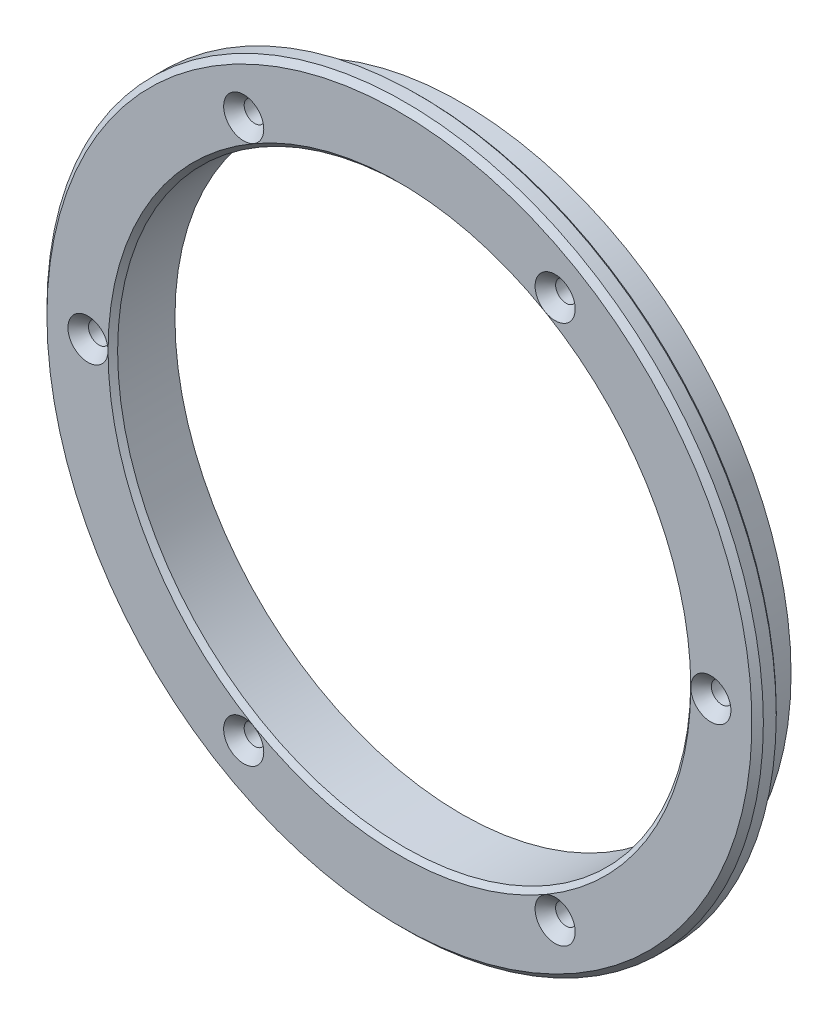
ISO-10303-21;
HEADER;
FILE_DESCRIPTION(('STEP AP214'),'2;1');
FILE_NAME('part.step','',(''),(''),'','','');
FILE_SCHEMA(('AUTOMOTIVE_DESIGN { 1 0 10303 214 1 1 1 1 }'));
ENDSEC;
DATA;
#1=APPLICATION_CONTEXT('core data for automotive mechanical design processes');
#2=APPLICATION_PROTOCOL_DEFINITION('international standard','automotive_design',2000,#1);
#3=PRODUCT_CONTEXT('',#1,'mechanical');
#4=PRODUCT('Part','Part','',(#3));
#5=PRODUCT_RELATED_PRODUCT_CATEGORY('part','',(#4));
#6=PRODUCT_DEFINITION_FORMATION('','',#4);
#7=PRODUCT_DEFINITION_CONTEXT('part definition',#1,'design');
#8=PRODUCT_DEFINITION('design','',#6,#7);
#9=PRODUCT_DEFINITION_SHAPE('','',#8);
#10=(LENGTH_UNIT() NAMED_UNIT(*) SI_UNIT(.MILLI.,.METRE.));
#11=(NAMED_UNIT(*) PLANE_ANGLE_UNIT() SI_UNIT($,.RADIAN.));
#12=(NAMED_UNIT(*) SI_UNIT($,.STERADIAN.) SOLID_ANGLE_UNIT());
#13=UNCERTAINTY_MEASURE_WITH_UNIT(LENGTH_MEASURE(1.E-05),#10,'distance_accuracy_value','');
#14=(GEOMETRIC_REPRESENTATION_CONTEXT(3) GLOBAL_UNCERTAINTY_ASSIGNED_CONTEXT((#13)) GLOBAL_UNIT_ASSIGNED_CONTEXT((#10,
#11,#12)) REPRESENTATION_CONTEXT('',''));
#15=CARTESIAN_POINT('',(0.,0.,0.));
#16=DIRECTION('',(0.,0.,1.));
#17=DIRECTION('',(1.,0.,0.));
#18=AXIS2_PLACEMENT_3D('',#15,#16,#17);
#19=CARTESIAN_POINT('',(0.,0.,12.7));
#20=DIRECTION('',(0.,0.,-1.));
#21=DIRECTION('',(-1.,0.,0.));
#22=AXIS2_PLACEMENT_3D('',#19,#20,#21);
#23=PLANE('',#22);
#24=CARTESIAN_POINT('',(0.,0.,12.7));
#25=DIRECTION('',(0.,0.,-1.));
#26=DIRECTION('',(-1.,0.,0.));
#27=AXIS2_PLACEMENT_3D('',#24,#25,#26);
#28=CIRCLE('',#27,46.863);
#29=CARTESIAN_POINT('',(-46.863,0.,12.7));
#30=VERTEX_POINT('',#29);
#31=EDGE_CURVE('E40',#30,#30,#28,.F.);
#32=ORIENTED_EDGE('',*,*,#31,.T.);
#33=EDGE_LOOP('',(#32));
#34=FACE_BOUND('',#33,.T.);
#35=CARTESIAN_POINT('',(0.,0.,12.7));
#36=DIRECTION('',(0.,0.,-1.));
#37=DIRECTION('',(-1.,0.,0.));
#38=AXIS2_PLACEMENT_3D('',#35,#36,#37);
#39=CIRCLE('',#38,38.735);
#40=CARTESIAN_POINT('',(19.3674999999999,33.5454940155903,12.7));
#41=VERTEX_POINT('',#40);
#42=CARTESIAN_POINT('',(38.735,0.,12.7));
#43=VERTEX_POINT('',#42);
#44=EDGE_CURVE('E76',#41,#43,#39,.T.);
#45=ORIENTED_EDGE('',*,*,#44,.T.);
#46=CARTESIAN_POINT('',(41.402,0.,12.7));
#47=DIRECTION('',(0.,0.,1.));
#48=DIRECTION('',(1.,0.,0.));
#49=AXIS2_PLACEMENT_3D('',#46,#47,#48);
#50=CIRCLE('',#49,2.667);
#51=EDGE_CURVE('E45',#43,#43,#50,.T.);
#52=ORIENTED_EDGE('',*,*,#51,.F.);
#53=CARTESIAN_POINT('',(19.3675000000002,-33.5454940155901,12.7));
#54=VERTEX_POINT('',#53);
#55=EDGE_CURVE('E51',#43,#54,#39,.T.);
#56=ORIENTED_EDGE('',*,*,#55,.T.);
#57=CARTESIAN_POINT('',(20.701,-35.8551837674833,12.7));
#58=DIRECTION('',(0.,0.,1.));
#59=DIRECTION('',(1.,0.,0.));
#60=AXIS2_PLACEMENT_3D('',#57,#58,#59);
#61=CIRCLE('',#60,2.667);
#62=EDGE_CURVE('E72',#54,#54,#61,.T.);
#63=ORIENTED_EDGE('',*,*,#62,.F.);
#64=CARTESIAN_POINT('',(-19.3674999999998,-33.5454940155904,12.7));
#65=VERTEX_POINT('',#64);
#66=EDGE_CURVE('E66',#54,#65,#39,.T.);
#67=ORIENTED_EDGE('',*,*,#66,.T.);
#68=CARTESIAN_POINT('',(-20.701,-35.8551837674834,12.7));
#69=DIRECTION('',(0.,0.,1.));
#70=DIRECTION('',(1.,0.,0.));
#71=AXIS2_PLACEMENT_3D('',#68,#69,#70);
#72=CIRCLE('',#71,2.667);
#73=EDGE_CURVE('E70',#65,#65,#72,.T.);
#74=ORIENTED_EDGE('',*,*,#73,.F.);
#75=CARTESIAN_POINT('',(-38.735,0.,12.7));
#76=VERTEX_POINT('',#75);
#77=EDGE_CURVE('E102',#65,#76,#39,.T.);
#78=ORIENTED_EDGE('',*,*,#77,.T.);
#79=CARTESIAN_POINT('',(-41.402,0.,12.7));
#80=DIRECTION('',(0.,0.,1.));
#81=DIRECTION('',(1.,0.,0.));
#82=AXIS2_PLACEMENT_3D('',#79,#80,#81);
#83=CIRCLE('',#82,2.667);
#84=EDGE_CURVE('E258',#76,#76,#83,.T.);
#85=ORIENTED_EDGE('',*,*,#84,.F.);
#86=CARTESIAN_POINT('',(-19.3675000000002,33.5454940155901,12.7));
#87=VERTEX_POINT('',#86);
#88=EDGE_CURVE('E105',#76,#87,#39,.T.);
#89=ORIENTED_EDGE('',*,*,#88,.T.);
#90=CARTESIAN_POINT('',(-20.701,35.8551837674833,12.7));
#91=DIRECTION('',(0.,0.,1.));
#92=DIRECTION('',(1.,0.,0.));
#93=AXIS2_PLACEMENT_3D('',#90,#91,#92);
#94=CIRCLE('',#93,2.667);
#95=EDGE_CURVE('E252',#87,#87,#94,.T.);
#96=ORIENTED_EDGE('',*,*,#95,.F.);
#97=EDGE_CURVE('E269',#87,#41,#39,.T.);
#98=ORIENTED_EDGE('',*,*,#97,.T.);
#99=CARTESIAN_POINT('',(20.701,35.8551837674834,12.7));
#100=DIRECTION('',(0.,0.,1.));
#101=DIRECTION('',(1.,0.,0.));
#102=AXIS2_PLACEMENT_3D('',#99,#100,#101);
#103=CIRCLE('',#102,2.667);
#104=EDGE_CURVE('E246',#41,#41,#103,.T.);
#105=ORIENTED_EDGE('',*,*,#104,.F.);
#106=EDGE_LOOP('',(#45,#52,#56,#63,#67,#74,#78,#85,#89,#96,#98,#105));
#107=FACE_BOUND('',#106,.T.);
#108=ADVANCED_FACE('F32',(#34,#107),#23,.F.);
#109=CARTESIAN_POINT('',(0.,0.,4.445));
#110=DIRECTION('',(0.,0.,1.));
#111=DIRECTION('',(1.,0.,0.));
#112=AXIS2_PLACEMENT_3D('',#109,#110,#111);
#113=CYLINDRICAL_SURFACE('',#112,47.625);
#114=CARTESIAN_POINT('',(0.,0.,11.938));
#115=DIRECTION('',(0.,0.,-1.));
#116=DIRECTION('',(-1.,0.,0.));
#117=AXIS2_PLACEMENT_3D('',#114,#115,#116);
#118=CIRCLE('',#117,47.625);
#119=CARTESIAN_POINT('',(-47.625,0.,11.938));
#120=VERTEX_POINT('',#119);
#121=EDGE_CURVE('E11',#120,#120,#118,.T.);
#122=ORIENTED_EDGE('',*,*,#121,.T.);
#123=EDGE_LOOP('',(#122));
#124=FACE_BOUND('',#123,.T.);
#125=CARTESIAN_POINT('',(0.,0.,10.2235));
#126=DIRECTION('',(0.,0.,1.));
#127=DIRECTION('',(1.,0.,0.));
#128=AXIS2_PLACEMENT_3D('',#125,#126,#127);
#129=CIRCLE('',#128,47.625);
#130=CARTESIAN_POINT('',(47.625,0.,10.2235));
#131=VERTEX_POINT('',#130);
#132=EDGE_CURVE('E108',#131,#131,#129,.T.);
#133=ORIENTED_EDGE('',*,*,#132,.T.);
#134=EDGE_LOOP('',(#133));
#135=FACE_BOUND('',#134,.T.);
#136=ADVANCED_FACE('F124',(#124,#135),#113,.T.);
#137=CARTESIAN_POINT('',(0.,0.,4.445));
#138=DIRECTION('',(0.,0.,-1.));
#139=DIRECTION('',(-1.,0.,0.));
#140=AXIS2_PLACEMENT_3D('',#137,#138,#139);
#141=PLANE('',#140);
#142=CARTESIAN_POINT('',(41.402,0.,4.445));
#143=DIRECTION('',(0.,0.,-1.));
#144=DIRECTION('',(-1.,0.,0.));
#145=AXIS2_PLACEMENT_3D('',#142,#143,#144);
#146=CIRCLE('',#145,1.397);
#147=CARTESIAN_POINT('',(40.005,0.,4.445));
#148=VERTEX_POINT('',#147);
#149=EDGE_CURVE('E164',#148,#148,#146,.T.);
#150=ORIENTED_EDGE('',*,*,#149,.F.);
#151=EDGE_LOOP('',(#150));
#152=FACE_BOUND('',#151,.T.);
#153=CARTESIAN_POINT('',(20.701,-35.8551837674833,4.445));
#154=DIRECTION('',(0.,0.,-1.));
#155=DIRECTION('',(-1.,0.,0.));
#156=AXIS2_PLACEMENT_3D('',#153,#154,#155);
#157=CIRCLE('',#156,1.397);
#158=CARTESIAN_POINT('',(19.304,-35.8551837674833,4.445));
#159=VERTEX_POINT('',#158);
#160=EDGE_CURVE('E168',#159,#159,#157,.T.);
#161=ORIENTED_EDGE('',*,*,#160,.F.);
#162=EDGE_LOOP('',(#161));
#163=FACE_BOUND('',#162,.T.);
#164=CARTESIAN_POINT('',(20.701,35.8551837674834,4.445));
#165=DIRECTION('',(0.,0.,-1.));
#166=DIRECTION('',(-1.,0.,0.));
#167=AXIS2_PLACEMENT_3D('',#164,#165,#166);
#168=CIRCLE('',#167,1.397);
#169=CARTESIAN_POINT('',(19.304,35.8551837674834,4.445));
#170=VERTEX_POINT('',#169);
#171=EDGE_CURVE('E172',#170,#170,#168,.T.);
#172=ORIENTED_EDGE('',*,*,#171,.F.);
#173=EDGE_LOOP('',(#172));
#174=FACE_BOUND('',#173,.T.);
#175=CARTESIAN_POINT('',(-20.701,35.8551837674833,4.445));
#176=DIRECTION('',(0.,0.,-1.));
#177=DIRECTION('',(-1.,0.,0.));
#178=AXIS2_PLACEMENT_3D('',#175,#176,#177);
#179=CIRCLE('',#178,1.397);
#180=CARTESIAN_POINT('',(-22.098,35.8551837674833,4.445));
#181=VERTEX_POINT('',#180);
#182=EDGE_CURVE('E176',#181,#181,#179,.T.);
#183=ORIENTED_EDGE('',*,*,#182,.F.);
#184=EDGE_LOOP('',(#183));
#185=FACE_BOUND('',#184,.T.);
#186=CARTESIAN_POINT('',(-41.402,0.,4.445));
#187=DIRECTION('',(0.,0.,-1.));
#188=DIRECTION('',(-1.,0.,0.));
#189=AXIS2_PLACEMENT_3D('',#186,#187,#188);
#190=CIRCLE('',#189,1.397);
#191=CARTESIAN_POINT('',(-42.799,0.,4.445));
#192=VERTEX_POINT('',#191);
#193=EDGE_CURVE('E80',#192,#192,#190,.T.);
#194=ORIENTED_EDGE('',*,*,#193,.F.);
#195=EDGE_LOOP('',(#194));
#196=FACE_BOUND('',#195,.T.);
#197=CARTESIAN_POINT('',(-20.701,-35.8551837674834,4.445));
#198=DIRECTION('',(0.,0.,-1.));
#199=DIRECTION('',(-1.,0.,0.));
#200=AXIS2_PLACEMENT_3D('',#197,#198,#199);
#201=CIRCLE('',#200,1.397);
#202=CARTESIAN_POINT('',(-22.098,-35.8551837674834,4.445));
#203=VERTEX_POINT('',#202);
#204=EDGE_CURVE('E83',#203,#203,#201,.T.);
#205=ORIENTED_EDGE('',*,*,#204,.F.);
#206=EDGE_LOOP('',(#205));
#207=FACE_BOUND('',#206,.T.);
#208=CARTESIAN_POINT('',(0.,0.,4.445));
#209=DIRECTION('',(0.,0.,-1.));
#210=DIRECTION('',(-1.,0.,0.));
#211=AXIS2_PLACEMENT_3D('',#208,#209,#210);
#212=CIRCLE('',#211,43.815);
#213=CARTESIAN_POINT('',(-43.815,0.,4.445));
#214=VERTEX_POINT('',#213);
#215=EDGE_CURVE('E92',#214,#214,#212,.T.);
#216=ORIENTED_EDGE('',*,*,#215,.T.);
#217=EDGE_LOOP('',(#216));
#218=FACE_BOUND('',#217,.T.);
#219=CARTESIAN_POINT('',(0.,0.,4.445));
#220=DIRECTION('',(0.,0.,1.));
#221=DIRECTION('',(-1.,0.,0.));
#222=AXIS2_PLACEMENT_3D('',#219,#220,#221);
#223=CIRCLE('',#222,38.1);
#224=CARTESIAN_POINT('',(-38.1,0.,4.445));
#225=VERTEX_POINT('',#224);
#226=EDGE_CURVE('E98',#225,#225,#223,.T.);
#227=ORIENTED_EDGE('',*,*,#226,.T.);
#228=EDGE_LOOP('',(#227));
#229=FACE_BOUND('',#228,.T.);
#230=ADVANCED_FACE('F129',(#152,#163,#174,#185,#196,#207,#218,#229),#141,.T.);
#231=CARTESIAN_POINT('',(0.,0.,4.445));
#232=DIRECTION('',(0.,0.,1.));
#233=DIRECTION('',(1.,0.,0.));
#234=AXIS2_PLACEMENT_3D('',#231,#232,#233);
#235=CYLINDRICAL_SURFACE('',#234,38.1);
#236=CARTESIAN_POINT('',(0.,0.,12.065));
#237=DIRECTION('',(0.,0.,-1.));
#238=DIRECTION('',(-1.,0.,0.));
#239=AXIS2_PLACEMENT_3D('',#236,#237,#238);
#240=CIRCLE('',#239,38.1);
#241=CARTESIAN_POINT('',(-38.1,0.,12.065));
#242=VERTEX_POINT('',#241);
#243=EDGE_CURVE('E74',#242,#242,#240,.F.);
#244=ORIENTED_EDGE('',*,*,#243,.T.);
#245=EDGE_LOOP('',(#244));
#246=FACE_BOUND('',#245,.T.);
#247=ORIENTED_EDGE('',*,*,#226,.F.);
#248=EDGE_LOOP('',(#247));
#249=FACE_BOUND('',#248,.T.);
#250=ADVANCED_FACE('F152',(#246,#249),#235,.F.);
#251=CARTESIAN_POINT('',(47.625,0.,9.8425));
#252=DIRECTION('',(0.,0.,1.));
#253=DIRECTION('',(1.,0.,0.));
#254=AXIS2_PLACEMENT_3D('',#251,#252,#253);
#255=PLANE('',#254);
#256=CARTESIAN_POINT('',(0.,0.,9.8425));
#257=DIRECTION('',(0.,0.,1.));
#258=DIRECTION('',(1.,0.,0.));
#259=AXIS2_PLACEMENT_3D('',#256,#257,#258);
#260=CIRCLE('',#259,47.244);
#261=CARTESIAN_POINT('',(47.244,0.,9.8425));
#262=VERTEX_POINT('',#261);
#263=EDGE_CURVE('E104',#262,#262,#260,.F.);
#264=ORIENTED_EDGE('',*,*,#263,.T.);
#265=EDGE_LOOP('',(#264));
#266=FACE_BOUND('',#265,.T.);
#267=CARTESIAN_POINT('',(0.,0.,9.8425));
#268=DIRECTION('',(0.,0.,-1.));
#269=DIRECTION('',(-1.,0.,0.));
#270=AXIS2_PLACEMENT_3D('',#267,#268,#269);
#271=CIRCLE('',#270,43.815);
#272=CARTESIAN_POINT('',(-43.815,0.,9.8425));
#273=VERTEX_POINT('',#272);
#274=EDGE_CURVE('E95',#273,#273,#271,.T.);
#275=ORIENTED_EDGE('',*,*,#274,.F.);
#276=EDGE_LOOP('',(#275));
#277=FACE_BOUND('',#276,.T.);
#278=ADVANCED_FACE('F145',(#266,#277),#255,.F.);
#279=CARTESIAN_POINT('',(0.,0.,9.8425));
#280=DIRECTION('',(0.,0.,-1.));
#281=DIRECTION('',(-1.,0.,0.));
#282=AXIS2_PLACEMENT_3D('',#279,#280,#281);
#283=CYLINDRICAL_SURFACE('',#282,43.815);
#284=ORIENTED_EDGE('',*,*,#215,.F.);
#285=EDGE_LOOP('',(#284));
#286=FACE_BOUND('',#285,.T.);
#287=ORIENTED_EDGE('',*,*,#274,.T.);
#288=EDGE_LOOP('',(#287));
#289=FACE_BOUND('',#288,.T.);
#290=ADVANCED_FACE('F138',(#286,#289),#283,.T.);
#291=CARTESIAN_POINT('',(0.,0.,12.065));
#292=DIRECTION('',(0.,0.,1.));
#293=DIRECTION('',(1.,0.,0.));
#294=AXIS2_PLACEMENT_3D('',#291,#292,#293);
#295=CONICAL_SURFACE('',#294,38.1,0.785398163397448);
#296=ORIENTED_EDGE('',*,*,#77,.F.);
#297=ORIENTED_EDGE('',*,*,#66,.F.);
#298=ORIENTED_EDGE('',*,*,#55,.F.);
#299=ORIENTED_EDGE('',*,*,#44,.F.);
#300=ORIENTED_EDGE('',*,*,#97,.F.);
#301=ORIENTED_EDGE('',*,*,#88,.F.);
#302=EDGE_LOOP('',(#296,#297,#298,#299,#300,#301));
#303=FACE_BOUND('',#302,.T.);
#304=ORIENTED_EDGE('',*,*,#243,.F.);
#305=EDGE_LOOP('',(#304));
#306=FACE_BOUND('',#305,.T.);
#307=ADVANCED_FACE('F135',(#303,#306),#295,.F.);
#308=CARTESIAN_POINT('',(-20.701,-35.8551837674834,12.7));
#309=DIRECTION('',(0.,0.,1.));
#310=DIRECTION('',(1.,0.,0.));
#311=AXIS2_PLACEMENT_3D('',#308,#309,#310);
#312=CYLINDRICAL_SURFACE('',#311,1.397);
#313=CARTESIAN_POINT('',(-20.701,-35.8551837674834,11.2390321228293));
#314=DIRECTION('',(0.,0.,1.));
#315=DIRECTION('',(1.,0.,0.));
#316=AXIS2_PLACEMENT_3D('',#313,#314,#315);
#317=CIRCLE('',#316,1.397);
#318=CARTESIAN_POINT('',(-19.304,-35.8551837674834,11.2390321228293));
#319=VERTEX_POINT('',#318);
#320=EDGE_CURVE('E79',#319,#319,#317,.T.);
#321=ORIENTED_EDGE('',*,*,#320,.T.);
#322=EDGE_LOOP('',(#321));
#323=FACE_BOUND('',#322,.T.);
#324=ORIENTED_EDGE('',*,*,#204,.T.);
#325=EDGE_LOOP('',(#324));
#326=FACE_BOUND('',#325,.T.);
#327=ADVANCED_FACE('F137',(#323,#326),#312,.F.);
#328=CARTESIAN_POINT('',(-20.701,-35.8551837674834,12.7));
#329=DIRECTION('',(0.,0.,1.));
#330=DIRECTION('',(1.,0.,0.));
#331=AXIS2_PLACEMENT_3D('',#328,#329,#330);
#332=CONICAL_SURFACE('',#331,2.667,0.715584993317674);
#333=ORIENTED_EDGE('',*,*,#320,.F.);
#334=EDGE_LOOP('',(#333));
#335=FACE_BOUND('',#334,.T.);
#336=ORIENTED_EDGE('',*,*,#73,.T.);
#337=EDGE_LOOP('',(#336));
#338=FACE_BOUND('',#337,.T.);
#339=ADVANCED_FACE('F78',(#335,#338),#332,.F.);
#340=CARTESIAN_POINT('',(-41.402,0.,12.7));
#341=DIRECTION('',(0.,0.,1.));
#342=DIRECTION('',(1.,0.,0.));
#343=AXIS2_PLACEMENT_3D('',#340,#341,#342);
#344=CYLINDRICAL_SURFACE('',#343,1.397);
#345=CARTESIAN_POINT('',(-41.402,0.,11.2390321228293));
#346=DIRECTION('',(0.,0.,1.));
#347=DIRECTION('',(1.,0.,0.));
#348=AXIS2_PLACEMENT_3D('',#345,#346,#347);
#349=CIRCLE('',#348,1.397);
#350=CARTESIAN_POINT('',(-40.005,0.,11.2390321228293));
#351=VERTEX_POINT('',#350);
#352=EDGE_CURVE('E86',#351,#351,#349,.T.);
#353=ORIENTED_EDGE('',*,*,#352,.T.);
#354=EDGE_LOOP('',(#353));
#355=FACE_BOUND('',#354,.T.);
#356=ORIENTED_EDGE('',*,*,#193,.T.);
#357=EDGE_LOOP('',(#356));
#358=FACE_BOUND('',#357,.T.);
#359=ADVANCED_FACE('F193',(#355,#358),#344,.F.);
#360=CARTESIAN_POINT('',(-41.402,0.,12.7));
#361=DIRECTION('',(0.,0.,1.));
#362=DIRECTION('',(1.,0.,0.));
#363=AXIS2_PLACEMENT_3D('',#360,#361,#362);
#364=CONICAL_SURFACE('',#363,2.667,0.715584993317674);
#365=ORIENTED_EDGE('',*,*,#352,.F.);
#366=EDGE_LOOP('',(#365));
#367=FACE_BOUND('',#366,.T.);
#368=ORIENTED_EDGE('',*,*,#84,.T.);
#369=EDGE_LOOP('',(#368));
#370=FACE_BOUND('',#369,.T.);
#371=ADVANCED_FACE('F197',(#367,#370),#364,.F.);
#372=CARTESIAN_POINT('',(-20.701,35.8551837674833,12.7));
#373=DIRECTION('',(0.,0.,1.));
#374=DIRECTION('',(1.,0.,0.));
#375=AXIS2_PLACEMENT_3D('',#372,#373,#374);
#376=CYLINDRICAL_SURFACE('',#375,1.397);
#377=CARTESIAN_POINT('',(-20.701,35.8551837674833,11.2390321228293));
#378=DIRECTION('',(0.,0.,1.));
#379=DIRECTION('',(1.,0.,0.));
#380=AXIS2_PLACEMENT_3D('',#377,#378,#379);
#381=CIRCLE('',#380,1.397);
#382=CARTESIAN_POINT('',(-19.304,35.8551837674833,11.2390321228293));
#383=VERTEX_POINT('',#382);
#384=EDGE_CURVE('E254',#383,#383,#381,.T.);
#385=ORIENTED_EDGE('',*,*,#384,.T.);
#386=EDGE_LOOP('',(#385));
#387=FACE_BOUND('',#386,.T.);
#388=ORIENTED_EDGE('',*,*,#182,.T.);
#389=EDGE_LOOP('',(#388));
#390=FACE_BOUND('',#389,.T.);
#391=ADVANCED_FACE('F201',(#387,#390),#376,.F.);
#392=CARTESIAN_POINT('',(-20.701,35.8551837674833,12.7));
#393=DIRECTION('',(0.,0.,1.));
#394=DIRECTION('',(1.,0.,0.));
#395=AXIS2_PLACEMENT_3D('',#392,#393,#394);
#396=CONICAL_SURFACE('',#395,2.667,0.715584993317674);
#397=ORIENTED_EDGE('',*,*,#384,.F.);
#398=EDGE_LOOP('',(#397));
#399=FACE_BOUND('',#398,.T.);
#400=ORIENTED_EDGE('',*,*,#95,.T.);
#401=EDGE_LOOP('',(#400));
#402=FACE_BOUND('',#401,.T.);
#403=ADVANCED_FACE('F205',(#399,#402),#396,.F.);
#404=CARTESIAN_POINT('',(20.701,35.8551837674834,12.7));
#405=DIRECTION('',(0.,0.,1.));
#406=DIRECTION('',(1.,0.,0.));
#407=AXIS2_PLACEMENT_3D('',#404,#405,#406);
#408=CYLINDRICAL_SURFACE('',#407,1.397);
#409=CARTESIAN_POINT('',(20.701,35.8551837674834,11.2390321228293));
#410=DIRECTION('',(0.,0.,1.));
#411=DIRECTION('',(1.,0.,0.));
#412=AXIS2_PLACEMENT_3D('',#409,#410,#411);
#413=CIRCLE('',#412,1.397);
#414=CARTESIAN_POINT('',(22.098,35.8551837674834,11.2390321228293));
#415=VERTEX_POINT('',#414);
#416=EDGE_CURVE('E248',#415,#415,#413,.T.);
#417=ORIENTED_EDGE('',*,*,#416,.T.);
#418=EDGE_LOOP('',(#417));
#419=FACE_BOUND('',#418,.T.);
#420=ORIENTED_EDGE('',*,*,#171,.T.);
#421=EDGE_LOOP('',(#420));
#422=FACE_BOUND('',#421,.T.);
#423=ADVANCED_FACE('F209',(#419,#422),#408,.F.);
#424=CARTESIAN_POINT('',(20.701,35.8551837674834,12.7));
#425=DIRECTION('',(0.,0.,1.));
#426=DIRECTION('',(1.,0.,0.));
#427=AXIS2_PLACEMENT_3D('',#424,#425,#426);
#428=CONICAL_SURFACE('',#427,2.667,0.715584993317674);
#429=ORIENTED_EDGE('',*,*,#416,.F.);
#430=EDGE_LOOP('',(#429));
#431=FACE_BOUND('',#430,.T.);
#432=ORIENTED_EDGE('',*,*,#104,.T.);
#433=EDGE_LOOP('',(#432));
#434=FACE_BOUND('',#433,.T.);
#435=ADVANCED_FACE('F213',(#431,#434),#428,.F.);
#436=CARTESIAN_POINT('',(20.701,-35.8551837674833,12.7));
#437=DIRECTION('',(0.,0.,1.));
#438=DIRECTION('',(1.,0.,0.));
#439=AXIS2_PLACEMENT_3D('',#436,#437,#438);
#440=CYLINDRICAL_SURFACE('',#439,1.397);
#441=CARTESIAN_POINT('',(20.701,-35.8551837674833,11.2390321228293));
#442=DIRECTION('',(0.,0.,1.));
#443=DIRECTION('',(1.,0.,0.));
#444=AXIS2_PLACEMENT_3D('',#441,#442,#443);
#445=CIRCLE('',#444,1.397);
#446=CARTESIAN_POINT('',(22.098,-35.8551837674833,11.2390321228293));
#447=VERTEX_POINT('',#446);
#448=EDGE_CURVE('E242',#447,#447,#445,.T.);
#449=ORIENTED_EDGE('',*,*,#448,.T.);
#450=EDGE_LOOP('',(#449));
#451=FACE_BOUND('',#450,.T.);
#452=ORIENTED_EDGE('',*,*,#160,.T.);
#453=EDGE_LOOP('',(#452));
#454=FACE_BOUND('',#453,.T.);
#455=ADVANCED_FACE('F217',(#451,#454),#440,.F.);
#456=CARTESIAN_POINT('',(20.701,-35.8551837674833,12.7));
#457=DIRECTION('',(0.,0.,1.));
#458=DIRECTION('',(1.,0.,0.));
#459=AXIS2_PLACEMENT_3D('',#456,#457,#458);
#460=CONICAL_SURFACE('',#459,2.667,0.715584993317674);
#461=ORIENTED_EDGE('',*,*,#448,.F.);
#462=EDGE_LOOP('',(#461));
#463=FACE_BOUND('',#462,.T.);
#464=ORIENTED_EDGE('',*,*,#62,.T.);
#465=EDGE_LOOP('',(#464));
#466=FACE_BOUND('',#465,.T.);
#467=ADVANCED_FACE('F221',(#463,#466),#460,.F.);
#468=CARTESIAN_POINT('',(41.402,0.,12.7));
#469=DIRECTION('',(0.,0.,1.));
#470=DIRECTION('',(1.,0.,0.));
#471=AXIS2_PLACEMENT_3D('',#468,#469,#470);
#472=CYLINDRICAL_SURFACE('',#471,1.397);
#473=CARTESIAN_POINT('',(41.402,0.,11.2390321228293));
#474=DIRECTION('',(0.,0.,1.));
#475=DIRECTION('',(1.,0.,0.));
#476=AXIS2_PLACEMENT_3D('',#473,#474,#475);
#477=CIRCLE('',#476,1.397);
#478=CARTESIAN_POINT('',(42.799,0.,11.2390321228293));
#479=VERTEX_POINT('',#478);
#480=EDGE_CURVE('E236',#479,#479,#477,.T.);
#481=ORIENTED_EDGE('',*,*,#480,.T.);
#482=EDGE_LOOP('',(#481));
#483=FACE_BOUND('',#482,.T.);
#484=ORIENTED_EDGE('',*,*,#149,.T.);
#485=EDGE_LOOP('',(#484));
#486=FACE_BOUND('',#485,.T.);
#487=ADVANCED_FACE('F225',(#483,#486),#472,.F.);
#488=CARTESIAN_POINT('',(41.402,0.,12.7));
#489=DIRECTION('',(0.,0.,1.));
#490=DIRECTION('',(1.,0.,0.));
#491=AXIS2_PLACEMENT_3D('',#488,#489,#490);
#492=CONICAL_SURFACE('',#491,2.667,0.715584993317674);
#493=ORIENTED_EDGE('',*,*,#480,.F.);
#494=EDGE_LOOP('',(#493));
#495=FACE_BOUND('',#494,.T.);
#496=ORIENTED_EDGE('',*,*,#51,.T.);
#497=EDGE_LOOP('',(#496));
#498=FACE_BOUND('',#497,.T.);
#499=ADVANCED_FACE('F120',(#495,#498),#492,.F.);
#500=CARTESIAN_POINT('',(0.,0.,9.8425));
#501=DIRECTION('',(0.,0.,1.));
#502=DIRECTION('',(1.,0.,0.));
#503=AXIS2_PLACEMENT_3D('',#500,#501,#502);
#504=CONICAL_SURFACE('',#503,47.244,0.785398163397466);
#505=ORIENTED_EDGE('',*,*,#132,.F.);
#506=EDGE_LOOP('',(#505));
#507=FACE_BOUND('',#506,.T.);
#508=ORIENTED_EDGE('',*,*,#263,.F.);
#509=EDGE_LOOP('',(#508));
#510=FACE_BOUND('',#509,.T.);
#511=ADVANCED_FACE('F115',(#507,#510),#504,.T.);
#512=CARTESIAN_POINT('',(0.,0.,12.7));
#513=DIRECTION('',(0.,0.,-1.));
#514=DIRECTION('',(-1.,0.,0.));
#515=AXIS2_PLACEMENT_3D('',#512,#513,#514);
#516=CONICAL_SURFACE('',#515,46.863,0.785398163397453);
#517=ORIENTED_EDGE('',*,*,#121,.F.);
#518=EDGE_LOOP('',(#517));
#519=FACE_BOUND('',#518,.T.);
#520=ORIENTED_EDGE('',*,*,#31,.F.);
#521=EDGE_LOOP('',(#520));
#522=FACE_BOUND('',#521,.T.);
#523=ADVANCED_FACE('F34',(#519,#522),#516,.T.);
#524=CLOSED_SHELL('',(#108,#136,#230,#250,#278,#290,#307,#327,#339,#359,#371,#391,#403,#423,
#435,#455,#467,#487,#499,#511,#523));
#525=MANIFOLD_SOLID_BREP('B2',#524);
#526=ADVANCED_BREP_SHAPE_REPRESENTATION('',(#18,#525),#14);
#527=SHAPE_DEFINITION_REPRESENTATION(#9,#526);
ENDSEC;
END-ISO-10303-21;
